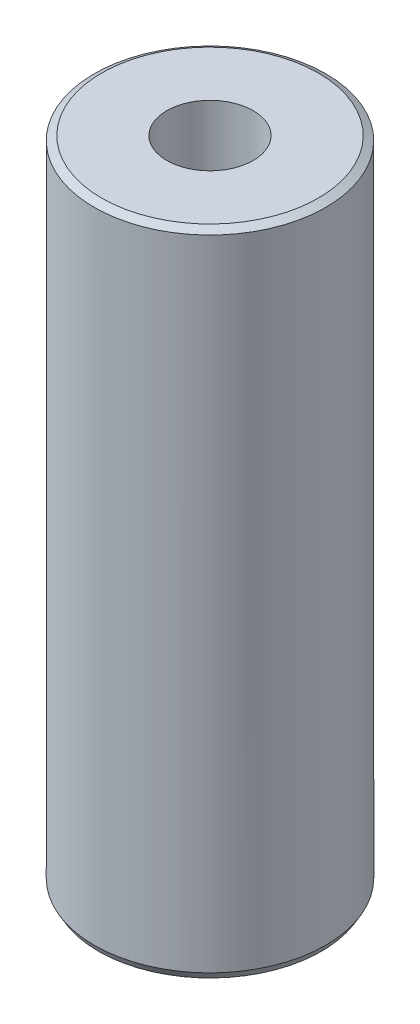
ISO-10303-21;
HEADER;
FILE_DESCRIPTION(('STEP AP214'),'2;1');
FILE_NAME('part.step','',(''),(''),'','','');
FILE_SCHEMA(('AUTOMOTIVE_DESIGN { 1 0 10303 214 1 1 1 1 }'));
ENDSEC;
DATA;
#1=APPLICATION_CONTEXT('core data for automotive mechanical design processes');
#2=APPLICATION_PROTOCOL_DEFINITION('international standard','automotive_design',2000,#1);
#3=PRODUCT_CONTEXT('',#1,'mechanical');
#4=PRODUCT('Part','Part','',(#3));
#5=PRODUCT_RELATED_PRODUCT_CATEGORY('part','',(#4));
#6=PRODUCT_DEFINITION_FORMATION('','',#4);
#7=PRODUCT_DEFINITION_CONTEXT('part definition',#1,'design');
#8=PRODUCT_DEFINITION('design','',#6,#7);
#9=PRODUCT_DEFINITION_SHAPE('','',#8);
#10=(LENGTH_UNIT() NAMED_UNIT(*) SI_UNIT(.MILLI.,.METRE.));
#11=(NAMED_UNIT(*) PLANE_ANGLE_UNIT() SI_UNIT($,.RADIAN.));
#12=(NAMED_UNIT(*) SI_UNIT($,.STERADIAN.) SOLID_ANGLE_UNIT());
#13=UNCERTAINTY_MEASURE_WITH_UNIT(LENGTH_MEASURE(1.E-05),#10,'distance_accuracy_value','');
#14=(GEOMETRIC_REPRESENTATION_CONTEXT(3) GLOBAL_UNCERTAINTY_ASSIGNED_CONTEXT((#13)) GLOBAL_UNIT_ASSIGNED_CONTEXT((#10,
#11,#12)) REPRESENTATION_CONTEXT('',''));
#15=CARTESIAN_POINT('',(0.,0.,0.));
#16=DIRECTION('',(0.,0.,1.));
#17=DIRECTION('',(1.,0.,0.));
#18=AXIS2_PLACEMENT_3D('',#15,#16,#17);
#19=CARTESIAN_POINT('',(0.,210.754686584001,0.));
#20=DIRECTION('',(0.,-1.,0.));
#21=DIRECTION('',(0.,0.,-1.));
#22=AXIS2_PLACEMENT_3D('',#19,#20,#21);
#23=CYLINDRICAL_SURFACE('',#22,37.5);
#24=CARTESIAN_POINT('',(0.,209.362493819037,0.));
#25=DIRECTION('',(0.,1.,0.));
#26=DIRECTION('',(0.,0.,1.));
#27=AXIS2_PLACEMENT_3D('',#24,#25,#26);
#28=CIRCLE('',#27,37.5);
#29=CARTESIAN_POINT('',(0.,209.362493819037,-37.5));
#30=VERTEX_POINT('',#29);
#31=EDGE_CURVE('E50',#30,#30,#28,.F.);
#32=CARTESIAN_POINT('',(0.,2.41134860284797,0.));
#33=DIRECTION('',(0.,1.,0.));
#34=DIRECTION('',(0.,0.,1.));
#35=AXIS2_PLACEMENT_3D('',#32,#33,#34);
#36=CIRCLE('',#35,37.5);
#37=CARTESIAN_POINT('',(0.,2.41134860284795,-37.5));
#38=VERTEX_POINT('',#37);
#39=EDGE_CURVE('E51',#38,#38,#36,.T.);
#40=CARTESIAN_POINT('',(0.,209.362493819037,-37.5));
#41=CARTESIAN_POINT('',(0.,207.206752723035,-37.5));
#42=CARTESIAN_POINT('',(0.,205.051011627033,-37.5));
#43=CARTESIAN_POINT('',(0.,200.739529435029,-37.5));
#44=CARTESIAN_POINT('',(0.,198.583788339028,-37.5));
#45=CARTESIAN_POINT('',(0.,194.272306147024,-37.5));
#46=CARTESIAN_POINT('',(0.,192.116565051022,-37.5));
#47=CARTESIAN_POINT('',(0.,187.805082859018,-37.5));
#48=CARTESIAN_POINT('',(0.,185.649341763016,-37.5));
#49=CARTESIAN_POINT('',(0.,181.337859571012,-37.5));
#50=CARTESIAN_POINT('',(0.,179.18211847501,-37.5));
#51=CARTESIAN_POINT('',(0.,174.870636283006,-37.5));
#52=CARTESIAN_POINT('',(0.,172.714895187004,-37.5));
#53=CARTESIAN_POINT('',(0.,168.403412995,-37.5));
#54=CARTESIAN_POINT('',(0.,166.247671898998,-37.5));
#55=CARTESIAN_POINT('',(0.,161.936189706994,-37.5));
#56=CARTESIAN_POINT('',(0.,159.780448610992,-37.5));
#57=CARTESIAN_POINT('',(0.,155.468966418988,-37.5));
#58=CARTESIAN_POINT('',(0.,153.313225322986,-37.5));
#59=CARTESIAN_POINT('',(0.,149.001743130982,-37.5));
#60=CARTESIAN_POINT('',(0.,146.84600203498,-37.5));
#61=CARTESIAN_POINT('',(0.,142.534519842976,-37.5));
#62=CARTESIAN_POINT('',(0.,140.378778746974,-37.5));
#63=CARTESIAN_POINT('',(0.,136.06729655497,-37.5));
#64=CARTESIAN_POINT('',(0.,133.911555458968,-37.5));
#65=CARTESIAN_POINT('',(0.,129.600073266964,-37.5));
#66=CARTESIAN_POINT('',(0.,127.444332170962,-37.5));
#67=CARTESIAN_POINT('',(0.,123.132849978958,-37.5));
#68=CARTESIAN_POINT('',(0.,120.977108882956,-37.5));
#69=CARTESIAN_POINT('',(0.,116.665626690953,-37.5));
#70=CARTESIAN_POINT('',(0.,114.509885594951,-37.5));
#71=CARTESIAN_POINT('',(0.,110.198403402947,-37.5));
#72=CARTESIAN_POINT('',(0.,108.042662306945,-37.5));
#73=CARTESIAN_POINT('',(0.,103.731180114941,-37.5));
#74=CARTESIAN_POINT('',(0.,101.575439018939,-37.5));
#75=CARTESIAN_POINT('',(0.,97.2639568269348,-37.5));
#76=CARTESIAN_POINT('',(0.,95.1082157309328,-37.5));
#77=CARTESIAN_POINT('',(0.,90.7967335389288,-37.5));
#78=CARTESIAN_POINT('',(0.,88.6409924429269,-37.5));
#79=CARTESIAN_POINT('',(0.,84.3295102509229,-37.5));
#80=CARTESIAN_POINT('',(0.,82.1737691549209,-37.5));
#81=CARTESIAN_POINT('',(0.,77.862286962917,-37.5));
#82=CARTESIAN_POINT('',(0.,75.706545866915,-37.5));
#83=CARTESIAN_POINT('',(0.,71.3950636749111,-37.5));
#84=CARTESIAN_POINT('',(0.,69.2393225789091,-37.5));
#85=CARTESIAN_POINT('',(0.,64.9278403869052,-37.5));
#86=CARTESIAN_POINT('',(0.,62.7720992909032,-37.5));
#87=CARTESIAN_POINT('',(0.,58.4606170988992,-37.5));
#88=CARTESIAN_POINT('',(0.,56.3048760028973,-37.5));
#89=CARTESIAN_POINT('',(0.,51.9933938108933,-37.5));
#90=CARTESIAN_POINT('',(0.,49.8376527148913,-37.5));
#91=CARTESIAN_POINT('',(0.,45.5261705228874,-37.5));
#92=CARTESIAN_POINT('',(0.,43.3704294268854,-37.5));
#93=CARTESIAN_POINT('',(0.,39.0589472348815,-37.5));
#94=CARTESIAN_POINT('',(0.,36.9032061388795,-37.5));
#95=CARTESIAN_POINT('',(0.,32.5917239468756,-37.5));
#96=CARTESIAN_POINT('',(0.,30.4359828508736,-37.5));
#97=CARTESIAN_POINT('',(0.,26.1245006588696,-37.5));
#98=CARTESIAN_POINT('',(0.,23.9687595628677,-37.5));
#99=CARTESIAN_POINT('',(0.,19.6572773708637,-37.5));
#100=CARTESIAN_POINT('',(0.,17.5015362748618,-37.5));
#101=CARTESIAN_POINT('',(0.,13.1900540828578,-37.5));
#102=CARTESIAN_POINT('',(0.,11.0343129868558,-37.5));
#103=CARTESIAN_POINT('',(0.,6.72283079485189,-37.5));
#104=CARTESIAN_POINT('',(0.,4.56708969884992,-37.5));
#105=CARTESIAN_POINT('',(0.,2.41134860284795,-37.5));
#106=B_SPLINE_CURVE_WITH_KNOTS('',3,(#40,#41,#42,#43,#44,#45,#46,#47,#48,#49,#50,#51,#52,#53,
#54,#55,#56,#57,#58,#59,#60,#61,#62,#63,#64,#65,#66,#67,#68,#69,#70,#71,#72,#73,#74,#75,#76,#77,
#78,#79,#80,#81,#82,#83,#84,#85,#86,#87,#88,#89,#90,#91,#92,#93,#94,#95,#96,#97,#98,#99,#100,
#101,#102,#103,#104,#105),.UNSPECIFIED.,.F.,.F.,(4,2,2,2,2,2,2,2,2,2,2,2,2,2,2,2,2,2,2,2,2,2,2,
2,2,2,2,2,2,2,2,2,4),(0.,6.46722328800589,12.9344465760118,19.4016698640177,25.8688931520236,
32.3361164400296,38.8033397280355,45.2705630160414,51.7377863040473,58.2050095920532,
64.6722328800592,71.1394561680651,77.606679456071,84.0739027440769,90.5411260320828,
97.0083493200888,103.475572608095,109.942795896101,116.410019184107,122.877242472112,
129.344465760118,135.811689048124,142.27891233613,148.746135624136,155.213358912142,
161.680582200148,168.147805488154,174.61502877616,181.082252064166,187.549475352172,
194.016698640178,200.483921928183,206.951145216189),.UNSPECIFIED.);
#107=EDGE_CURVE('BSEAM39',#30,#38,#106,.T.);
#108=ORIENTED_EDGE('',*,*,#31,.T.);
#109=ORIENTED_EDGE('',*,*,#39,.T.);
#110=ORIENTED_EDGE('',*,*,#107,.T.);
#111=ORIENTED_EDGE('',*,*,#107,.F.);
#112=EDGE_LOOP('',(#108,#110,#109,#111));
#113=FACE_BOUND('',#112,.T.);
#114=ADVANCED_FACE('F39',(#113),#23,.T.);
#115=CARTESIAN_POINT('',(0.,210.754686584001,0.));
#116=DIRECTION('',(0.,1.,0.));
#117=DIRECTION('',(0.,0.,1.));
#118=AXIS2_PLACEMENT_3D('',#115,#116,#117);
#119=PLANE('',#118);
#120=CARTESIAN_POINT('',(0.,210.754686584001,0.));
#121=DIRECTION('',(0.,1.,0.));
#122=DIRECTION('',(0.,0.,1.));
#123=AXIS2_PLACEMENT_3D('',#120,#121,#122);
#124=CIRCLE('',#123,35.0886513971526);
#125=CARTESIAN_POINT('',(0.,210.754686584001,35.0886513971526));
#126=VERTEX_POINT('',#125);
#127=EDGE_CURVE('E54',#126,#126,#124,.T.);
#128=ORIENTED_EDGE('',*,*,#127,.T.);
#129=EDGE_LOOP('',(#128));
#130=FACE_BOUND('',#129,.T.);
#131=CARTESIAN_POINT('',(0.,210.754686584001,0.));
#132=DIRECTION('',(0.,1.,0.));
#133=DIRECTION('',(0.,0.,1.));
#134=AXIS2_PLACEMENT_3D('',#131,#132,#133);
#135=CIRCLE('',#134,13.9963104571457);
#136=CARTESIAN_POINT('',(0.,210.754686584001,-13.9963104571457));
#137=VERTEX_POINT('',#136);
#138=EDGE_CURVE('E58',#137,#137,#135,.T.);
#139=ORIENTED_EDGE('',*,*,#138,.F.);
#140=EDGE_LOOP('',(#139));
#141=FACE_BOUND('',#140,.T.);
#142=ADVANCED_FACE('F69',(#130,#141),#119,.T.);
#143=CARTESIAN_POINT('',(0.,0.,0.));
#144=DIRECTION('',(0.,1.,0.));
#145=DIRECTION('',(0.,0.,1.));
#146=AXIS2_PLACEMENT_3D('',#143,#144,#145);
#147=PLANE('',#146);
#148=CARTESIAN_POINT('',(0.,0.,0.));
#149=DIRECTION('',(0.,1.,0.));
#150=DIRECTION('',(0.,0.,1.));
#151=AXIS2_PLACEMENT_3D('',#148,#149,#150);
#152=CIRCLE('',#151,36.1078072350357);
#153=CARTESIAN_POINT('',(0.,0.,36.1078072350357));
#154=VERTEX_POINT('',#153);
#155=EDGE_CURVE('E10',#154,#154,#152,.F.);
#156=ORIENTED_EDGE('',*,*,#155,.T.);
#157=EDGE_LOOP('',(#156));
#158=FACE_BOUND('',#157,.T.);
#159=CARTESIAN_POINT('',(0.,0.,0.));
#160=DIRECTION('',(0.,1.,0.));
#161=DIRECTION('',(0.,0.,1.));
#162=AXIS2_PLACEMENT_3D('',#159,#160,#161);
#163=CIRCLE('',#162,13.9963104571457);
#164=CARTESIAN_POINT('',(0.,0.,-13.9963104571457));
#165=VERTEX_POINT('',#164);
#166=EDGE_CURVE('E63',#165,#165,#163,.T.);
#167=ORIENTED_EDGE('',*,*,#166,.T.);
#168=EDGE_LOOP('',(#167));
#169=FACE_BOUND('',#168,.T.);
#170=ADVANCED_FACE('F75',(#158,#169),#147,.F.);
#171=CARTESIAN_POINT('',(0.,210.754686584001,0.));
#172=DIRECTION('',(0.,-1.,0.));
#173=DIRECTION('',(0.,0.,-1.));
#174=AXIS2_PLACEMENT_3D('',#171,#172,#173);
#175=CYLINDRICAL_SURFACE('',#174,13.9963104571457);
#176=CARTESIAN_POINT('',(0.,210.754686584001,-13.9963104571457));
#177=CARTESIAN_POINT('',(0.,208.559325265418,-13.9963104571457));
#178=CARTESIAN_POINT('',(0.,206.363963946835,-13.9963104571457));
#179=CARTESIAN_POINT('',(0.,201.973241309668,-13.9963104571457));
#180=CARTESIAN_POINT('',(0.,199.777879991085,-13.9963104571457));
#181=CARTESIAN_POINT('',(0.,195.387157353918,-13.9963104571457));
#182=CARTESIAN_POINT('',(0.,193.191796035335,-13.9963104571457));
#183=CARTESIAN_POINT('',(0.,188.801073398168,-13.9963104571457));
#184=CARTESIAN_POINT('',(0.,186.605712079585,-13.9963104571457));
#185=CARTESIAN_POINT('',(0.,182.214989442418,-13.9963104571457));
#186=CARTESIAN_POINT('',(0.,180.019628123834,-13.9963104571457));
#187=CARTESIAN_POINT('',(0.,175.628905486668,-13.9963104571457));
#188=CARTESIAN_POINT('',(0.,173.433544168084,-13.9963104571457));
#189=CARTESIAN_POINT('',(0.,169.042821530918,-13.9963104571457));
#190=CARTESIAN_POINT('',(0.,166.847460212334,-13.9963104571457));
#191=CARTESIAN_POINT('',(0.,162.456737575168,-13.9963104571457));
#192=CARTESIAN_POINT('',(0.,160.261376256584,-13.9963104571457));
#193=CARTESIAN_POINT('',(0.,155.870653619418,-13.9963104571457));
#194=CARTESIAN_POINT('',(0.,153.675292300834,-13.9963104571457));
#195=CARTESIAN_POINT('',(0.,149.284569663668,-13.9963104571457));
#196=CARTESIAN_POINT('',(0.,147.089208345084,-13.9963104571457));
#197=CARTESIAN_POINT('',(0.,142.698485707918,-13.9963104571457));
#198=CARTESIAN_POINT('',(0.,140.503124389334,-13.9963104571457));
#199=CARTESIAN_POINT('',(0.,136.112401752168,-13.9963104571457));
#200=CARTESIAN_POINT('',(0.,133.917040433584,-13.9963104571457));
#201=CARTESIAN_POINT('',(0.,129.526317796417,-13.9963104571457));
#202=CARTESIAN_POINT('',(0.,127.330956477834,-13.9963104571457));
#203=CARTESIAN_POINT('',(0.,122.940233840667,-13.9963104571457));
#204=CARTESIAN_POINT('',(0.,120.744872522084,-13.9963104571457));
#205=CARTESIAN_POINT('',(0.,116.354149884917,-13.9963104571457));
#206=CARTESIAN_POINT('',(0.,114.158788566334,-13.9963104571457));
#207=CARTESIAN_POINT('',(0.,109.768065929167,-13.9963104571457));
#208=CARTESIAN_POINT('',(0.,107.572704610584,-13.9963104571457));
#209=CARTESIAN_POINT('',(0.,103.181981973417,-13.9963104571457));
#210=CARTESIAN_POINT('',(0.,100.986620654834,-13.9963104571457));
#211=CARTESIAN_POINT('',(0.,96.5958980176673,-13.9963104571457));
#212=CARTESIAN_POINT('',(0.,94.4005366990839,-13.9963104571457));
#213=CARTESIAN_POINT('',(0.,90.0098140619172,-13.9963104571457));
#214=CARTESIAN_POINT('',(0.,87.8144527433339,-13.9963104571457));
#215=CARTESIAN_POINT('',(0.,83.4237301061672,-13.9963104571457));
#216=CARTESIAN_POINT('',(0.,81.2283687875839,-13.9963104571457));
#217=CARTESIAN_POINT('',(0.,76.8376461504172,-13.9963104571457));
#218=CARTESIAN_POINT('',(0.,74.6422848318338,-13.9963104571457));
#219=CARTESIAN_POINT('',(0.,70.2515621946671,-13.9963104571457));
#220=CARTESIAN_POINT('',(0.,68.0562008760838,-13.9963104571457));
#221=CARTESIAN_POINT('',(0.,63.6654782389171,-13.9963104571457));
#222=CARTESIAN_POINT('',(0.,61.4701169203337,-13.9963104571457));
#223=CARTESIAN_POINT('',(0.,57.079394283167,-13.9963104571457));
#224=CARTESIAN_POINT('',(0.,54.8840329645837,-13.9963104571457));
#225=CARTESIAN_POINT('',(0.,50.493310327417,-13.9963104571457));
#226=CARTESIAN_POINT('',(0.,48.2979490088336,-13.9963104571457));
#227=CARTESIAN_POINT('',(0.,43.9072263716669,-13.9963104571457));
#228=CARTESIAN_POINT('',(0.,41.7118650530836,-13.9963104571457));
#229=CARTESIAN_POINT('',(0.,37.3211424159169,-13.9963104571457));
#230=CARTESIAN_POINT('',(0.,35.1257810973335,-13.9963104571457));
#231=CARTESIAN_POINT('',(0.,30.7350584601668,-13.9963104571457));
#232=CARTESIAN_POINT('',(0.,28.5396971415835,-13.9963104571457));
#233=CARTESIAN_POINT('',(0.,24.1489745044168,-13.9963104571457));
#234=CARTESIAN_POINT('',(0.,21.9536131858335,-13.9963104571457));
#235=CARTESIAN_POINT('',(0.,17.5628905486668,-13.9963104571457));
#236=CARTESIAN_POINT('',(0.,15.3675292300834,-13.9963104571457));
#237=CARTESIAN_POINT('',(0.,10.9768065929167,-13.9963104571457));
#238=CARTESIAN_POINT('',(0.,8.78144527433337,-13.9963104571457));
#239=CARTESIAN_POINT('',(0.,4.39072263716668,-13.9963104571457));
#240=CARTESIAN_POINT('',(0.,2.19536131858332,-13.9963104571457));
#241=CARTESIAN_POINT('',(0.,0.,-13.9963104571457));
#242=B_SPLINE_CURVE_WITH_KNOTS('',3,(#176,#177,#178,#179,#180,#181,#182,#183,#184,#185,#186,
#187,#188,#189,#190,#191,#192,#193,#194,#195,#196,#197,#198,#199,#200,#201,#202,#203,#204,#205,
#206,#207,#208,#209,#210,#211,#212,#213,#214,#215,#216,#217,#218,#219,#220,#221,#222,#223,#224,
#225,#226,#227,#228,#229,#230,#231,#232,#233,#234,#235,#236,#237,#238,#239,#240,#241),
.UNSPECIFIED.,.F.,.F.,(4,2,2,2,2,2,2,2,2,2,2,2,2,2,2,2,2,2,2,2,2,2,2,2,2,2,2,2,2,2,2,2,4),(0.,
6.58608395575006,13.1721679115001,19.7582518672501,26.3443358230002,32.9304197787502,
39.5165037345003,46.1025876902503,52.6886716460004,59.2747556017504,65.8608395575004,
72.4469235132505,79.0330074690006,85.6190914247506,92.2051753805006,98.7912593362507,
105.377343292001,111.963427247751,118.549511203501,125.135595159251,131.721679115001,
138.307763070751,144.893847026501,151.479930982251,158.066014938001,164.652098893751,
171.238182849501,177.824266805251,184.410350761001,190.996434716751,197.582518672501,
204.168602628251,210.754686584001),.UNSPECIFIED.);
#243=EDGE_CURVE('BSEAM70',#137,#165,#242,.T.);
#244=ORIENTED_EDGE('',*,*,#138,.T.);
#245=ORIENTED_EDGE('',*,*,#166,.F.);
#246=ORIENTED_EDGE('',*,*,#243,.T.);
#247=ORIENTED_EDGE('',*,*,#243,.F.);
#248=EDGE_LOOP('',(#244,#246,#245,#247));
#249=FACE_BOUND('',#248,.T.);
#250=ADVANCED_FACE('F70',(#249),#175,.F.);
#251=CARTESIAN_POINT('',(0.,210.754686584001,0.));
#252=DIRECTION('',(0.,-1.,0.));
#253=DIRECTION('',(0.,0.,-1.));
#254=AXIS2_PLACEMENT_3D('',#251,#252,#253);
#255=CONICAL_SURFACE('',#254,35.0886513971526,1.04719755119659);
#256=ORIENTED_EDGE('',*,*,#31,.F.);
#257=EDGE_LOOP('',(#256));
#258=FACE_BOUND('',#257,.T.);
#259=ORIENTED_EDGE('',*,*,#127,.F.);
#260=EDGE_LOOP('',(#259));
#261=FACE_BOUND('',#260,.T.);
#262=ADVANCED_FACE('F81',(#258,#261),#255,.T.);
#263=CARTESIAN_POINT('',(0.,2.41134860284797,0.));
#264=DIRECTION('',(0.,1.,0.));
#265=DIRECTION('',(0.,0.,1.));
#266=AXIS2_PLACEMENT_3D('',#263,#264,#265);
#267=CONICAL_SURFACE('',#266,37.5,0.523598775598302);
#268=ORIENTED_EDGE('',*,*,#155,.F.);
#269=EDGE_LOOP('',(#268));
#270=FACE_BOUND('',#269,.T.);
#271=ORIENTED_EDGE('',*,*,#39,.F.);
#272=EDGE_LOOP('',(#271));
#273=FACE_BOUND('',#272,.T.);
#274=ADVANCED_FACE('F45',(#270,#273),#267,.T.);
#275=CLOSED_SHELL('',(#114,#142,#170,#250,#262,#274));
#276=MANIFOLD_SOLID_BREP('B2',#275);
#277=ADVANCED_BREP_SHAPE_REPRESENTATION('',(#18,#276),#14);
#278=SHAPE_DEFINITION_REPRESENTATION(#9,#277);
ENDSEC;
END-ISO-10303-21;
